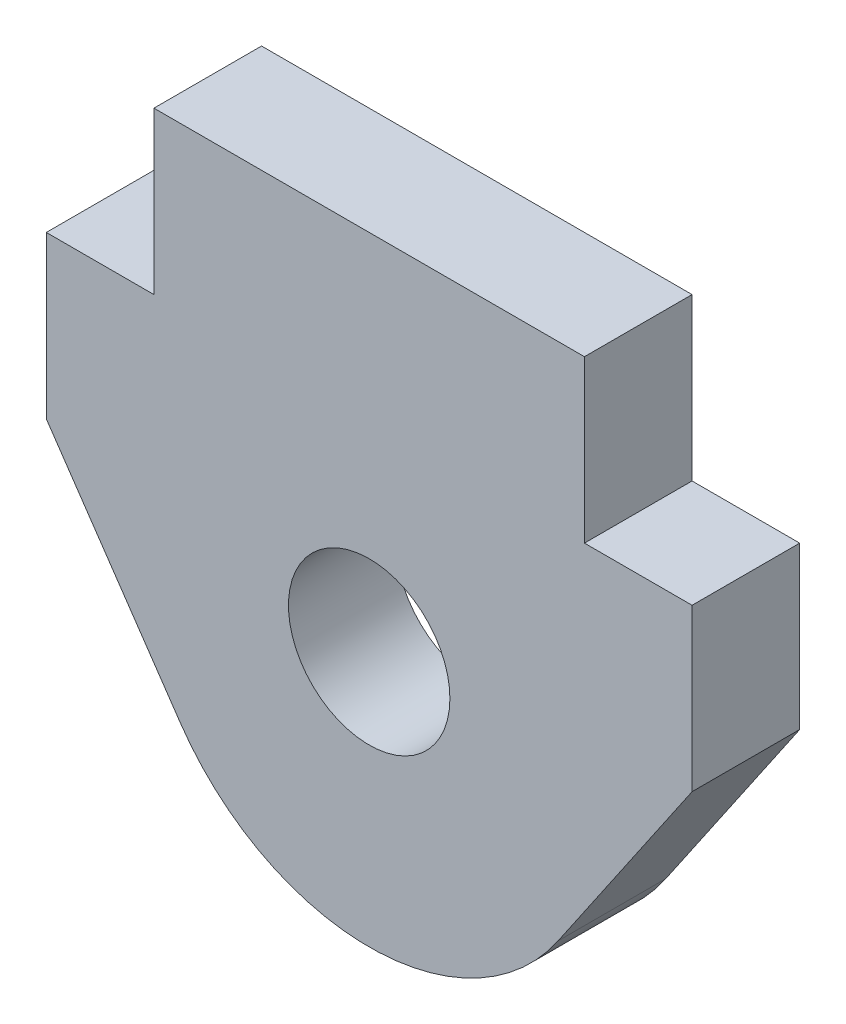
ISO-10303-21;
HEADER;
FILE_DESCRIPTION(('STEP AP214'),'2;1');
FILE_NAME('part.step','',(''),(''),'','','');
FILE_SCHEMA(('AUTOMOTIVE_DESIGN { 1 0 10303 214 1 1 1 1 }'));
ENDSEC;
DATA;
#1=APPLICATION_CONTEXT('core data for automotive mechanical design processes');
#2=APPLICATION_PROTOCOL_DEFINITION('international standard','automotive_design',2000,#1);
#3=PRODUCT_CONTEXT('',#1,'mechanical');
#4=PRODUCT('Part','Part','',(#3));
#5=PRODUCT_RELATED_PRODUCT_CATEGORY('part','',(#4));
#6=PRODUCT_DEFINITION_FORMATION('','',#4);
#7=PRODUCT_DEFINITION_CONTEXT('part definition',#1,'design');
#8=PRODUCT_DEFINITION('design','',#6,#7);
#9=PRODUCT_DEFINITION_SHAPE('','',#8);
#10=(LENGTH_UNIT() NAMED_UNIT(*) SI_UNIT(.MILLI.,.METRE.));
#11=(NAMED_UNIT(*) PLANE_ANGLE_UNIT() SI_UNIT($,.RADIAN.));
#12=(NAMED_UNIT(*) SI_UNIT($,.STERADIAN.) SOLID_ANGLE_UNIT());
#13=UNCERTAINTY_MEASURE_WITH_UNIT(LENGTH_MEASURE(1.E-05),#10,'distance_accuracy_value','');
#14=(GEOMETRIC_REPRESENTATION_CONTEXT(3) GLOBAL_UNCERTAINTY_ASSIGNED_CONTEXT((#13)) GLOBAL_UNIT_ASSIGNED_CONTEXT((#10,
#11,#12)) REPRESENTATION_CONTEXT('',''));
#15=CARTESIAN_POINT('',(0.,0.,0.));
#16=DIRECTION('',(0.,0.,1.));
#17=DIRECTION('',(1.,0.,0.));
#18=AXIS2_PLACEMENT_3D('',#15,#16,#17);
#19=CARTESIAN_POINT('',(0.,0.,-1.));
#20=DIRECTION('',(0.,0.,1.));
#21=DIRECTION('',(1.,0.,0.));
#22=AXIS2_PLACEMENT_3D('',#19,#20,#21);
#23=PLANE('',#22);
#24=DIRECTION('',(0.,-1.,0.));
#25=VECTOR('',#24,1.);
#26=CARTESIAN_POINT('',(-6.,0.,-1.));
#27=LINE('',#26,#25);
#28=CARTESIAN_POINT('',(-6.,0.,-1.));
#29=VERTEX_POINT('',#28);
#30=CARTESIAN_POINT('',(-6.,-3.,-1.));
#31=VERTEX_POINT('',#30);
#32=EDGE_CURVE('E131',#29,#31,#27,.T.);
#33=ORIENTED_EDGE('',*,*,#32,.F.);
#34=DIRECTION('',(1.,0.,0.));
#35=VECTOR('',#34,1.);
#36=CARTESIAN_POINT('',(0.,0.,-1.));
#37=LINE('',#36,#35);
#38=CARTESIAN_POINT('',(-4.,0.,-1.));
#39=VERTEX_POINT('',#38);
#40=EDGE_CURVE('E147',#29,#39,#37,.T.);
#41=ORIENTED_EDGE('',*,*,#40,.T.);
#42=DIRECTION('',(0.,-1.,0.));
#43=VECTOR('',#42,1.);
#44=CARTESIAN_POINT('',(-4.,0.,-1.));
#45=LINE('',#44,#43);
#46=CARTESIAN_POINT('',(-4.,3.,-1.));
#47=VERTEX_POINT('',#46);
#48=EDGE_CURVE('E149',#47,#39,#45,.T.);
#49=ORIENTED_EDGE('',*,*,#48,.F.);
#50=DIRECTION('',(1.,0.,0.));
#51=VECTOR('',#50,1.);
#52=CARTESIAN_POINT('',(0.,3.,-1.));
#53=LINE('',#52,#51);
#54=CARTESIAN_POINT('',(4.,3.,-1.));
#55=VERTEX_POINT('',#54);
#56=EDGE_CURVE('E170',#47,#55,#53,.T.);
#57=ORIENTED_EDGE('',*,*,#56,.T.);
#58=DIRECTION('',(0.,1.,0.));
#59=VECTOR('',#58,1.);
#60=CARTESIAN_POINT('',(4.,0.,-1.));
#61=LINE('',#60,#59);
#62=CARTESIAN_POINT('',(4.,0.,-1.));
#63=VERTEX_POINT('',#62);
#64=EDGE_CURVE('E185',#55,#63,#61,.F.);
#65=ORIENTED_EDGE('',*,*,#64,.T.);
#66=DIRECTION('',(1.,0.,0.));
#67=VECTOR('',#66,1.);
#68=CARTESIAN_POINT('',(0.,0.,-1.));
#69=LINE('',#68,#67);
#70=CARTESIAN_POINT('',(6.,0.,-1.));
#71=VERTEX_POINT('',#70);
#72=EDGE_CURVE('E123',#63,#71,#69,.T.);
#73=ORIENTED_EDGE('',*,*,#72,.T.);
#74=DIRECTION('',(0.,-1.,0.));
#75=VECTOR('',#74,1.);
#76=CARTESIAN_POINT('',(6.,0.,-1.));
#77=LINE('',#76,#75);
#78=CARTESIAN_POINT('',(6.,-3.,-1.));
#79=VERTEX_POINT('',#78);
#80=EDGE_CURVE('E94',#71,#79,#77,.T.);
#81=ORIENTED_EDGE('',*,*,#80,.T.);
#82=DIRECTION('',(-0.563934312119362,-0.8258196483582,0.));
#83=VECTOR('',#82,1.);
#84=CARTESIAN_POINT('',(5.48899265568138,-3.74831393714583,-1.));
#85=LINE('',#84,#83);
#86=CARTESIAN_POINT('',(3.50973350552235,-6.64672082650729,-1.));
#87=VERTEX_POINT('',#86);
#88=EDGE_CURVE('E87',#79,#87,#85,.T.);
#89=ORIENTED_EDGE('',*,*,#88,.T.);
#90=CARTESIAN_POINT('',(0.,-4.25,-1.));
#91=DIRECTION('',(0.,0.,1.));
#92=DIRECTION('',(1.,0.,0.));
#93=AXIS2_PLACEMENT_3D('',#90,#91,#92);
#94=CIRCLE('',#93,4.25);
#95=CARTESIAN_POINT('',(-3.50973350552235,-6.64672082650729,-1.));
#96=VERTEX_POINT('',#95);
#97=EDGE_CURVE('E91',#96,#87,#94,.T.);
#98=ORIENTED_EDGE('',*,*,#97,.F.);
#99=DIRECTION('',(0.563934312119362,-0.8258196483582,0.));
#100=VECTOR('',#99,1.);
#101=CARTESIAN_POINT('',(-5.48899265568138,-3.74831393714583,-1.));
#102=LINE('',#101,#100);
#103=EDGE_CURVE('E82',#31,#96,#102,.T.);
#104=ORIENTED_EDGE('',*,*,#103,.F.);
#105=EDGE_LOOP('',(#33,#41,#49,#57,#65,#73,#81,#89,#98,#104));
#106=FACE_BOUND('',#105,.T.);
#107=CARTESIAN_POINT('',(0.,-3.75,-1.));
#108=DIRECTION('',(0.,0.,1.));
#109=DIRECTION('',(1.,0.,0.));
#110=AXIS2_PLACEMENT_3D('',#107,#108,#109);
#111=CIRCLE('',#110,1.5);
#112=CARTESIAN_POINT('',(1.5,-3.75,-1.));
#113=VERTEX_POINT('',#112);
#114=EDGE_CURVE('E19',#113,#113,#111,.T.);
#115=ORIENTED_EDGE('',*,*,#114,.T.);
#116=EDGE_LOOP('',(#115));
#117=FACE_BOUND('',#116,.T.);
#118=ADVANCED_FACE('F16',(#106,#117),#23,.F.);
#119=CARTESIAN_POINT('',(0.,-3.75,-1.));
#120=DIRECTION('',(0.,0.,1.));
#121=DIRECTION('',(1.,0.,0.));
#122=AXIS2_PLACEMENT_3D('',#119,#120,#121);
#123=CYLINDRICAL_SURFACE('',#122,1.5);
#124=CARTESIAN_POINT('',(0.,-3.75,1.));
#125=DIRECTION('',(0.,0.,1.));
#126=DIRECTION('',(1.,0.,0.));
#127=AXIS2_PLACEMENT_3D('',#124,#125,#126);
#128=CIRCLE('',#127,1.5);
#129=CARTESIAN_POINT('',(1.5,-3.75,1.));
#130=VERTEX_POINT('',#129);
#131=EDGE_CURVE('E130',#130,#130,#128,.F.);
#132=ORIENTED_EDGE('',*,*,#131,.F.);
#133=EDGE_LOOP('',(#132));
#134=FACE_BOUND('',#133,.T.);
#135=ORIENTED_EDGE('',*,*,#114,.F.);
#136=EDGE_LOOP('',(#135));
#137=FACE_BOUND('',#136,.T.);
#138=ADVANCED_FACE('F279',(#134,#137),#123,.F.);
#139=CARTESIAN_POINT('',(-5.48899265568138,-3.74831393714583,-1.));
#140=DIRECTION('',(-0.8258196483582,-0.563934312119362,0.));
#141=DIRECTION('',(0.563934312119362,-0.8258196483582,0.));
#142=AXIS2_PLACEMENT_3D('',#139,#140,#141);
#143=PLANE('',#142);
#144=ORIENTED_EDGE('',*,*,#103,.T.);
#145=DIRECTION('',(0.,0.,1.));
#146=VECTOR('',#145,1.);
#147=CARTESIAN_POINT('',(-3.50973350552235,-6.64672082650729,-1.));
#148=LINE('',#147,#146);
#149=CARTESIAN_POINT('',(-3.50973350552235,-6.64672082650729,1.));
#150=VERTEX_POINT('',#149);
#151=EDGE_CURVE('E104',#150,#96,#148,.F.);
#152=ORIENTED_EDGE('',*,*,#151,.F.);
#153=DIRECTION('',(0.563934312119362,-0.825819648358201,0.));
#154=VECTOR('',#153,1.);
#155=CARTESIAN_POINT('',(-6.,-3.,1.));
#156=LINE('',#155,#154);
#157=CARTESIAN_POINT('',(-6.,-3.,1.));
#158=VERTEX_POINT('',#157);
#159=EDGE_CURVE('E211',#158,#150,#156,.T.);
#160=ORIENTED_EDGE('',*,*,#159,.F.);
#161=DIRECTION('',(0.,0.,1.));
#162=VECTOR('',#161,1.);
#163=CARTESIAN_POINT('',(-6.,-3.,-1.));
#164=LINE('',#163,#162);
#165=EDGE_CURVE('E127',#31,#158,#164,.T.);
#166=ORIENTED_EDGE('',*,*,#165,.F.);
#167=EDGE_LOOP('',(#144,#152,#160,#166));
#168=FACE_BOUND('',#167,.T.);
#169=ADVANCED_FACE('F277',(#168),#143,.T.);
#170=CARTESIAN_POINT('',(0.,-4.25,-1.));
#171=DIRECTION('',(0.,0.,1.));
#172=DIRECTION('',(1.,0.,0.));
#173=AXIS2_PLACEMENT_3D('',#170,#171,#172);
#174=CYLINDRICAL_SURFACE('',#173,4.25);
#175=ORIENTED_EDGE('',*,*,#97,.T.);
#176=DIRECTION('',(0.,0.,1.));
#177=VECTOR('',#176,1.);
#178=CARTESIAN_POINT('',(3.50973350552235,-6.64672082650729,-1.));
#179=LINE('',#178,#177);
#180=CARTESIAN_POINT('',(3.50973350552235,-6.64672082650729,1.));
#181=VERTEX_POINT('',#180);
#182=EDGE_CURVE('E98',#87,#181,#179,.T.);
#183=ORIENTED_EDGE('',*,*,#182,.T.);
#184=CARTESIAN_POINT('',(0.,-4.25,1.));
#185=DIRECTION('',(0.,0.,1.));
#186=DIRECTION('',(1.,0.,0.));
#187=AXIS2_PLACEMENT_3D('',#184,#185,#186);
#188=CIRCLE('',#187,4.25);
#189=EDGE_CURVE('E209',#150,#181,#188,.T.);
#190=ORIENTED_EDGE('',*,*,#189,.F.);
#191=ORIENTED_EDGE('',*,*,#151,.T.);
#192=EDGE_LOOP('',(#175,#183,#190,#191));
#193=FACE_BOUND('',#192,.T.);
#194=ADVANCED_FACE('F101',(#193),#174,.T.);
#195=CARTESIAN_POINT('',(5.48899265568138,-3.74831393714583,-1.));
#196=DIRECTION('',(-0.8258196483582,0.563934312119362,0.));
#197=DIRECTION('',(-0.563934312119362,-0.8258196483582,0.));
#198=AXIS2_PLACEMENT_3D('',#195,#196,#197);
#199=PLANE('',#198);
#200=ORIENTED_EDGE('',*,*,#182,.F.);
#201=ORIENTED_EDGE('',*,*,#88,.F.);
#202=DIRECTION('',(0.,0.,1.));
#203=VECTOR('',#202,1.);
#204=CARTESIAN_POINT('',(6.,-3.,-1.));
#205=LINE('',#204,#203);
#206=CARTESIAN_POINT('',(6.,-3.,1.));
#207=VERTEX_POINT('',#206);
#208=EDGE_CURVE('E110',#79,#207,#205,.T.);
#209=ORIENTED_EDGE('',*,*,#208,.T.);
#210=DIRECTION('',(0.563934312119362,0.825819648358201,0.));
#211=VECTOR('',#210,1.);
#212=CARTESIAN_POINT('',(3.50973350552235,-6.64672082650729,1.));
#213=LINE('',#212,#211);
#214=EDGE_CURVE('E107',#181,#207,#213,.T.);
#215=ORIENTED_EDGE('',*,*,#214,.F.);
#216=EDGE_LOOP('',(#200,#201,#209,#215));
#217=FACE_BOUND('',#216,.T.);
#218=ADVANCED_FACE('F105',(#217),#199,.F.);
#219=CARTESIAN_POINT('',(6.,0.,-1.));
#220=DIRECTION('',(-1.,0.,0.));
#221=DIRECTION('',(0.,-1.,0.));
#222=AXIS2_PLACEMENT_3D('',#219,#220,#221);
#223=PLANE('',#222);
#224=ORIENTED_EDGE('',*,*,#208,.F.);
#225=ORIENTED_EDGE('',*,*,#80,.F.);
#226=DIRECTION('',(0.,0.,1.));
#227=VECTOR('',#226,1.);
#228=CARTESIAN_POINT('',(6.,0.,-1.));
#229=LINE('',#228,#227);
#230=CARTESIAN_POINT('',(6.,0.,1.));
#231=VERTEX_POINT('',#230);
#232=EDGE_CURVE('E187',#71,#231,#229,.T.);
#233=ORIENTED_EDGE('',*,*,#232,.T.);
#234=DIRECTION('',(0.,1.,0.));
#235=VECTOR('',#234,1.);
#236=CARTESIAN_POINT('',(6.,0.,1.));
#237=LINE('',#236,#235);
#238=EDGE_CURVE('E116',#207,#231,#237,.T.);
#239=ORIENTED_EDGE('',*,*,#238,.F.);
#240=EDGE_LOOP('',(#224,#225,#233,#239));
#241=FACE_BOUND('',#240,.T.);
#242=ADVANCED_FACE('F242',(#241),#223,.F.);
#243=CARTESIAN_POINT('',(0.,0.,-1.));
#244=DIRECTION('',(0.,-1.,0.));
#245=DIRECTION('',(1.,0.,0.));
#246=AXIS2_PLACEMENT_3D('',#243,#244,#245);
#247=PLANE('',#246);
#248=ORIENTED_EDGE('',*,*,#232,.F.);
#249=ORIENTED_EDGE('',*,*,#72,.F.);
#250=DIRECTION('',(0.,0.,1.));
#251=VECTOR('',#250,1.);
#252=CARTESIAN_POINT('',(4.,0.,-1.));
#253=LINE('',#252,#251);
#254=CARTESIAN_POINT('',(4.,0.,1.));
#255=VERTEX_POINT('',#254);
#256=EDGE_CURVE('E172',#63,#255,#253,.T.);
#257=ORIENTED_EDGE('',*,*,#256,.T.);
#258=DIRECTION('',(1.,0.,0.));
#259=VECTOR('',#258,1.);
#260=CARTESIAN_POINT('',(0.,0.,1.));
#261=LINE('',#260,#259);
#262=EDGE_CURVE('E119',#231,#255,#261,.F.);
#263=ORIENTED_EDGE('',*,*,#262,.F.);
#264=EDGE_LOOP('',(#248,#249,#257,#263));
#265=FACE_BOUND('',#264,.T.);
#266=ADVANCED_FACE('F243',(#265),#247,.F.);
#267=CARTESIAN_POINT('',(4.,0.,-1.));
#268=DIRECTION('',(-1.,0.,0.));
#269=DIRECTION('',(0.,0.,1.));
#270=AXIS2_PLACEMENT_3D('',#267,#268,#269);
#271=PLANE('',#270);
#272=ORIENTED_EDGE('',*,*,#256,.F.);
#273=ORIENTED_EDGE('',*,*,#64,.F.);
#274=DIRECTION('',(0.,0.,1.));
#275=VECTOR('',#274,1.);
#276=CARTESIAN_POINT('',(4.,3.,-1.));
#277=LINE('',#276,#275);
#278=CARTESIAN_POINT('',(4.,3.,1.));
#279=VERTEX_POINT('',#278);
#280=EDGE_CURVE('E167',#55,#279,#277,.T.);
#281=ORIENTED_EDGE('',*,*,#280,.T.);
#282=DIRECTION('',(0.,1.,0.));
#283=VECTOR('',#282,1.);
#284=CARTESIAN_POINT('',(4.,0.,1.));
#285=LINE('',#284,#283);
#286=EDGE_CURVE('E182',#255,#279,#285,.T.);
#287=ORIENTED_EDGE('',*,*,#286,.F.);
#288=EDGE_LOOP('',(#272,#273,#281,#287));
#289=FACE_BOUND('',#288,.T.);
#290=ADVANCED_FACE('F233',(#289),#271,.F.);
#291=CARTESIAN_POINT('',(0.,3.,-1.));
#292=DIRECTION('',(0.,-1.,0.));
#293=DIRECTION('',(1.,0.,0.));
#294=AXIS2_PLACEMENT_3D('',#291,#292,#293);
#295=PLANE('',#294);
#296=ORIENTED_EDGE('',*,*,#280,.F.);
#297=ORIENTED_EDGE('',*,*,#56,.F.);
#298=DIRECTION('',(0.,0.,1.));
#299=VECTOR('',#298,1.);
#300=CARTESIAN_POINT('',(-4.,3.,-1.));
#301=LINE('',#300,#299);
#302=CARTESIAN_POINT('',(-4.,3.,1.));
#303=VERTEX_POINT('',#302);
#304=EDGE_CURVE('E159',#303,#47,#301,.F.);
#305=ORIENTED_EDGE('',*,*,#304,.F.);
#306=DIRECTION('',(1.,0.,0.));
#307=VECTOR('',#306,1.);
#308=CARTESIAN_POINT('',(0.,3.,1.));
#309=LINE('',#308,#307);
#310=EDGE_CURVE('E177',#279,#303,#309,.F.);
#311=ORIENTED_EDGE('',*,*,#310,.F.);
#312=EDGE_LOOP('',(#296,#297,#305,#311));
#313=FACE_BOUND('',#312,.T.);
#314=ADVANCED_FACE('F251',(#313),#295,.F.);
#315=CARTESIAN_POINT('',(-4.,0.,-1.));
#316=DIRECTION('',(-1.,0.,0.));
#317=DIRECTION('',(0.,-1.,0.));
#318=AXIS2_PLACEMENT_3D('',#315,#316,#317);
#319=PLANE('',#318);
#320=ORIENTED_EDGE('',*,*,#48,.T.);
#321=DIRECTION('',(0.,0.,1.));
#322=VECTOR('',#321,1.);
#323=CARTESIAN_POINT('',(-4.,0.,-1.));
#324=LINE('',#323,#322);
#325=CARTESIAN_POINT('',(-4.,0.,1.));
#326=VERTEX_POINT('',#325);
#327=EDGE_CURVE('E144',#39,#326,#324,.T.);
#328=ORIENTED_EDGE('',*,*,#327,.T.);
#329=DIRECTION('',(0.,1.,0.));
#330=VECTOR('',#329,1.);
#331=CARTESIAN_POINT('',(-4.,0.,1.));
#332=LINE('',#331,#330);
#333=EDGE_CURVE('E154',#303,#326,#332,.F.);
#334=ORIENTED_EDGE('',*,*,#333,.F.);
#335=ORIENTED_EDGE('',*,*,#304,.T.);
#336=EDGE_LOOP('',(#320,#328,#334,#335));
#337=FACE_BOUND('',#336,.T.);
#338=ADVANCED_FACE('F266',(#337),#319,.T.);
#339=CARTESIAN_POINT('',(0.,0.,-1.));
#340=DIRECTION('',(0.,-1.,0.));
#341=DIRECTION('',(1.,0.,0.));
#342=AXIS2_PLACEMENT_3D('',#339,#340,#341);
#343=PLANE('',#342);
#344=ORIENTED_EDGE('',*,*,#327,.F.);
#345=ORIENTED_EDGE('',*,*,#40,.F.);
#346=DIRECTION('',(0.,0.,1.));
#347=VECTOR('',#346,1.);
#348=CARTESIAN_POINT('',(-6.,0.,-1.));
#349=LINE('',#348,#347);
#350=CARTESIAN_POINT('',(-6.,0.,1.));
#351=VERTEX_POINT('',#350);
#352=EDGE_CURVE('E34',#351,#29,#349,.F.);
#353=ORIENTED_EDGE('',*,*,#352,.F.);
#354=DIRECTION('',(1.,0.,0.));
#355=VECTOR('',#354,1.);
#356=CARTESIAN_POINT('',(0.,0.,1.));
#357=LINE('',#356,#355);
#358=EDGE_CURVE('E25',#326,#351,#357,.F.);
#359=ORIENTED_EDGE('',*,*,#358,.F.);
#360=EDGE_LOOP('',(#344,#345,#353,#359));
#361=FACE_BOUND('',#360,.T.);
#362=ADVANCED_FACE('F260',(#361),#343,.F.);
#363=CARTESIAN_POINT('',(-6.,0.,-1.));
#364=DIRECTION('',(-1.,0.,0.));
#365=DIRECTION('',(0.,-1.,0.));
#366=AXIS2_PLACEMENT_3D('',#363,#364,#365);
#367=PLANE('',#366);
#368=ORIENTED_EDGE('',*,*,#32,.T.);
#369=ORIENTED_EDGE('',*,*,#165,.T.);
#370=DIRECTION('',(0.,1.,0.));
#371=VECTOR('',#370,1.);
#372=CARTESIAN_POINT('',(-6.,0.,1.));
#373=LINE('',#372,#371);
#374=EDGE_CURVE('E10',#351,#158,#373,.F.);
#375=ORIENTED_EDGE('',*,*,#374,.F.);
#376=ORIENTED_EDGE('',*,*,#352,.T.);
#377=EDGE_LOOP('',(#368,#369,#375,#376));
#378=FACE_BOUND('',#377,.T.);
#379=ADVANCED_FACE('F255',(#378),#367,.T.);
#380=CARTESIAN_POINT('',(0.,0.,1.));
#381=DIRECTION('',(0.,0.,1.));
#382=DIRECTION('',(1.,0.,0.));
#383=AXIS2_PLACEMENT_3D('',#380,#381,#382);
#384=PLANE('',#383);
#385=ORIENTED_EDGE('',*,*,#358,.T.);
#386=ORIENTED_EDGE('',*,*,#374,.T.);
#387=ORIENTED_EDGE('',*,*,#159,.T.);
#388=ORIENTED_EDGE('',*,*,#189,.T.);
#389=ORIENTED_EDGE('',*,*,#214,.T.);
#390=ORIENTED_EDGE('',*,*,#238,.T.);
#391=ORIENTED_EDGE('',*,*,#262,.T.);
#392=ORIENTED_EDGE('',*,*,#286,.T.);
#393=ORIENTED_EDGE('',*,*,#310,.T.);
#394=ORIENTED_EDGE('',*,*,#333,.T.);
#395=EDGE_LOOP('',(#385,#386,#387,#388,#389,#390,#391,#392,#393,#394));
#396=FACE_BOUND('',#395,.T.);
#397=ORIENTED_EDGE('',*,*,#131,.T.);
#398=EDGE_LOOP('',(#397));
#399=FACE_BOUND('',#398,.T.);
#400=ADVANCED_FACE('F226',(#396,#399),#384,.T.);
#401=CLOSED_SHELL('',(#118,#138,#169,#194,#218,#242,#266,#290,#314,#338,#362,#379,#400));
#402=MANIFOLD_SOLID_BREP('B1',#401);
#403=ADVANCED_BREP_SHAPE_REPRESENTATION('',(#18,#402),#14);
#404=SHAPE_DEFINITION_REPRESENTATION(#9,#403);
ENDSEC;
END-ISO-10303-21;
